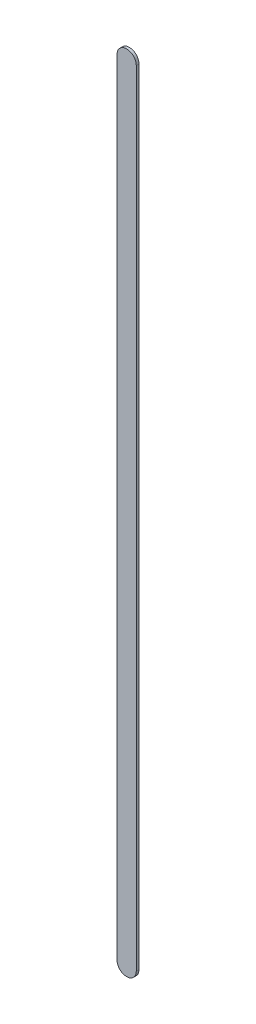
ISO-10303-21;
HEADER;
FILE_DESCRIPTION(('STEP AP214'),'2;1');
FILE_NAME('part.step','',(''),(''),'','','');
FILE_SCHEMA(('AUTOMOTIVE_DESIGN { 1 0 10303 214 1 1 1 1 }'));
ENDSEC;
DATA;
#1=APPLICATION_CONTEXT('core data for automotive mechanical design processes');
#2=APPLICATION_PROTOCOL_DEFINITION('international standard','automotive_design',2000,#1);
#3=PRODUCT_CONTEXT('',#1,'mechanical');
#4=PRODUCT('Part','Part','',(#3));
#5=PRODUCT_RELATED_PRODUCT_CATEGORY('part','',(#4));
#6=PRODUCT_DEFINITION_FORMATION('','',#4);
#7=PRODUCT_DEFINITION_CONTEXT('part definition',#1,'design');
#8=PRODUCT_DEFINITION('design','',#6,#7);
#9=PRODUCT_DEFINITION_SHAPE('','',#8);
#10=(LENGTH_UNIT() NAMED_UNIT(*) SI_UNIT(.MILLI.,.METRE.));
#11=(NAMED_UNIT(*) PLANE_ANGLE_UNIT() SI_UNIT($,.RADIAN.));
#12=(NAMED_UNIT(*) SI_UNIT($,.STERADIAN.) SOLID_ANGLE_UNIT());
#13=UNCERTAINTY_MEASURE_WITH_UNIT(LENGTH_MEASURE(1.E-05),#10,'distance_accuracy_value','');
#14=(GEOMETRIC_REPRESENTATION_CONTEXT(3) GLOBAL_UNCERTAINTY_ASSIGNED_CONTEXT((#13)) GLOBAL_UNIT_ASSIGNED_CONTEXT((#10,
#11,#12)) REPRESENTATION_CONTEXT('',''));
#15=CARTESIAN_POINT('',(0.,0.,0.));
#16=DIRECTION('',(0.,0.,1.));
#17=DIRECTION('',(1.,0.,0.));
#18=AXIS2_PLACEMENT_3D('',#15,#16,#17);
#19=CARTESIAN_POINT('',(81.62195258,68.65902702,0.));
#20=DIRECTION('',(-1.,0.,0.));
#21=DIRECTION('',(0.,1.,0.));
#22=AXIS2_PLACEMENT_3D('',#19,#20,#21);
#23=PLANE('',#22);
#24=DIRECTION('',(0.,1.,0.));
#25=VECTOR('',#24,1.);
#26=CARTESIAN_POINT('',(81.62195258,68.65902702,0.03556));
#27=LINE('',#26,#25);
#28=CARTESIAN_POINT('',(81.62195258,68.65902702,0.03556));
#29=VERTEX_POINT('',#28);
#30=CARTESIAN_POINT('',(81.62195258,79.00899108,0.03556));
#31=VERTEX_POINT('',#30);
#32=EDGE_CURVE('E11',#29,#31,#27,.T.);
#33=ORIENTED_EDGE('',*,*,#32,.F.);
#34=DIRECTION('',(0.,0.,1.));
#35=VECTOR('',#34,1.);
#36=CARTESIAN_POINT('',(81.62195258,68.65902702,0.));
#37=LINE('',#36,#35);
#38=CARTESIAN_POINT('',(81.62195258,68.65902702,0.));
#39=VERTEX_POINT('',#38);
#40=EDGE_CURVE('E24',#39,#29,#37,.T.);
#41=ORIENTED_EDGE('',*,*,#40,.F.);
#42=DIRECTION('',(0.,1.,0.));
#43=VECTOR('',#42,1.);
#44=CARTESIAN_POINT('',(81.62195258,68.65902702,0.));
#45=LINE('',#44,#43);
#46=CARTESIAN_POINT('',(81.62195258,79.00899108,0.));
#47=VERTEX_POINT('',#46);
#48=EDGE_CURVE('E75',#39,#47,#45,.T.);
#49=ORIENTED_EDGE('',*,*,#48,.T.);
#50=DIRECTION('',(0.,0.,1.));
#51=VECTOR('',#50,1.);
#52=CARTESIAN_POINT('',(81.62195258,79.00899108,0.));
#53=LINE('',#52,#51);
#54=EDGE_CURVE('E37',#47,#31,#53,.T.);
#55=ORIENTED_EDGE('',*,*,#54,.T.);
#56=EDGE_LOOP('',(#33,#41,#49,#55));
#57=FACE_BOUND('',#56,.T.);
#58=ADVANCED_FACE('F17',(#57),#23,.F.);
#59=CARTESIAN_POINT('',(81.49495258,79.00899108,0.));
#60=DIRECTION('',(0.,0.,-1.));
#61=DIRECTION('',(1.,1.1189649382048E-13,0.));
#62=AXIS2_PLACEMENT_3D('',#59,#60,#61);
#63=CYLINDRICAL_SURFACE('',#62,0.127000000000005);
#64=CARTESIAN_POINT('',(81.49495258,79.00899108,0.03556));
#65=DIRECTION('',(0.,0.,1.));
#66=DIRECTION('',(1.,1.1189649382048E-13,0.));
#67=AXIS2_PLACEMENT_3D('',#64,#65,#66);
#68=CIRCLE('',#67,0.127000000000005);
#69=CARTESIAN_POINT('',(81.36795258,79.00899108,0.03556));
#70=VERTEX_POINT('',#69);
#71=EDGE_CURVE('E83',#31,#70,#68,.T.);
#72=ORIENTED_EDGE('',*,*,#71,.F.);
#73=ORIENTED_EDGE('',*,*,#54,.F.);
#74=CARTESIAN_POINT('',(81.49495258,79.00899108,0.));
#75=DIRECTION('',(0.,0.,1.));
#76=DIRECTION('',(1.,1.1189649382048E-13,0.));
#77=AXIS2_PLACEMENT_3D('',#74,#75,#76);
#78=CIRCLE('',#77,0.127000000000005);
#79=CARTESIAN_POINT('',(81.36795258,79.00899108,0.));
#80=VERTEX_POINT('',#79);
#81=EDGE_CURVE('E81',#47,#80,#78,.T.);
#82=ORIENTED_EDGE('',*,*,#81,.T.);
#83=DIRECTION('',(0.,0.,1.));
#84=VECTOR('',#83,1.);
#85=CARTESIAN_POINT('',(81.36795258,79.00899108,0.));
#86=LINE('',#85,#84);
#87=EDGE_CURVE('E67',#80,#70,#86,.T.);
#88=ORIENTED_EDGE('',*,*,#87,.T.);
#89=EDGE_LOOP('',(#72,#73,#82,#88));
#90=FACE_BOUND('',#89,.T.);
#91=ADVANCED_FACE('F89',(#90),#63,.T.);
#92=CARTESIAN_POINT('',(81.36795258,79.00899108,0.));
#93=DIRECTION('',(1.,0.,0.));
#94=DIRECTION('',(0.,-1.,0.));
#95=AXIS2_PLACEMENT_3D('',#92,#93,#94);
#96=PLANE('',#95);
#97=DIRECTION('',(0.,-1.,0.));
#98=VECTOR('',#97,1.);
#99=CARTESIAN_POINT('',(81.36795258,79.00899108,0.03556));
#100=LINE('',#99,#98);
#101=CARTESIAN_POINT('',(81.36795258,68.65902702,0.03556));
#102=VERTEX_POINT('',#101);
#103=EDGE_CURVE('E71',#70,#102,#100,.T.);
#104=ORIENTED_EDGE('',*,*,#103,.F.);
#105=ORIENTED_EDGE('',*,*,#87,.F.);
#106=DIRECTION('',(0.,-1.,0.));
#107=VECTOR('',#106,1.);
#108=CARTESIAN_POINT('',(81.36795258,79.00899108,0.));
#109=LINE('',#108,#107);
#110=CARTESIAN_POINT('',(81.36795258,68.65902702,0.));
#111=VERTEX_POINT('',#110);
#112=EDGE_CURVE('E63',#80,#111,#109,.T.);
#113=ORIENTED_EDGE('',*,*,#112,.T.);
#114=DIRECTION('',(0.,0.,1.));
#115=VECTOR('',#114,1.);
#116=CARTESIAN_POINT('',(81.36795258,68.65902702,0.));
#117=LINE('',#116,#115);
#118=EDGE_CURVE('E53',#111,#102,#117,.T.);
#119=ORIENTED_EDGE('',*,*,#118,.T.);
#120=EDGE_LOOP('',(#104,#105,#113,#119));
#121=FACE_BOUND('',#120,.T.);
#122=ADVANCED_FACE('F66',(#121),#96,.F.);
#123=CARTESIAN_POINT('',(81.49495258,68.65902702,0.));
#124=DIRECTION('',(0.,0.,-1.));
#125=DIRECTION('',(-1.,0.,0.));
#126=AXIS2_PLACEMENT_3D('',#123,#124,#125);
#127=CYLINDRICAL_SURFACE('',#126,0.127);
#128=CARTESIAN_POINT('',(81.49495258,68.65902702,0.03556));
#129=DIRECTION('',(0.,0.,1.));
#130=DIRECTION('',(-1.,0.,0.));
#131=AXIS2_PLACEMENT_3D('',#128,#129,#130);
#132=CIRCLE('',#131,0.127);
#133=EDGE_CURVE('E59',#102,#29,#132,.T.);
#134=ORIENTED_EDGE('',*,*,#133,.F.);
#135=ORIENTED_EDGE('',*,*,#118,.F.);
#136=CARTESIAN_POINT('',(81.49495258,68.65902702,0.));
#137=DIRECTION('',(0.,0.,1.));
#138=DIRECTION('',(-1.,0.,0.));
#139=AXIS2_PLACEMENT_3D('',#136,#137,#138);
#140=CIRCLE('',#139,0.127);
#141=EDGE_CURVE('E57',#111,#39,#140,.T.);
#142=ORIENTED_EDGE('',*,*,#141,.T.);
#143=ORIENTED_EDGE('',*,*,#40,.T.);
#144=EDGE_LOOP('',(#134,#135,#142,#143));
#145=FACE_BOUND('',#144,.T.);
#146=ADVANCED_FACE('F55',(#145),#127,.T.);
#147=CARTESIAN_POINT('',(81.62195258,68.65902702,0.));
#148=DIRECTION('',(0.,0.,-1.));
#149=DIRECTION('',(-1.,0.,0.));
#150=AXIS2_PLACEMENT_3D('',#147,#148,#149);
#151=PLANE('',#150);
#152=ORIENTED_EDGE('',*,*,#141,.F.);
#153=ORIENTED_EDGE('',*,*,#112,.F.);
#154=ORIENTED_EDGE('',*,*,#81,.F.);
#155=ORIENTED_EDGE('',*,*,#48,.F.);
#156=EDGE_LOOP('',(#152,#153,#154,#155));
#157=FACE_BOUND('',#156,.T.);
#158=ADVANCED_FACE('F74',(#157),#151,.T.);
#159=CARTESIAN_POINT('',(81.62195258,68.65902702,0.03556));
#160=DIRECTION('',(0.,0.,-1.));
#161=DIRECTION('',(-1.,0.,0.));
#162=AXIS2_PLACEMENT_3D('',#159,#160,#161);
#163=PLANE('',#162);
#164=ORIENTED_EDGE('',*,*,#32,.T.);
#165=ORIENTED_EDGE('',*,*,#71,.T.);
#166=ORIENTED_EDGE('',*,*,#103,.T.);
#167=ORIENTED_EDGE('',*,*,#133,.T.);
#168=EDGE_LOOP('',(#164,#165,#166,#167));
#169=FACE_BOUND('',#168,.T.);
#170=ADVANCED_FACE('F91',(#169),#163,.F.);
#171=CLOSED_SHELL('',(#58,#91,#122,#146,#158,#170));
#172=MANIFOLD_SOLID_BREP('B1',#171);
#173=ADVANCED_BREP_SHAPE_REPRESENTATION('',(#18,#172),#14);
#174=SHAPE_DEFINITION_REPRESENTATION(#9,#173);
ENDSEC;
END-ISO-10303-21;
